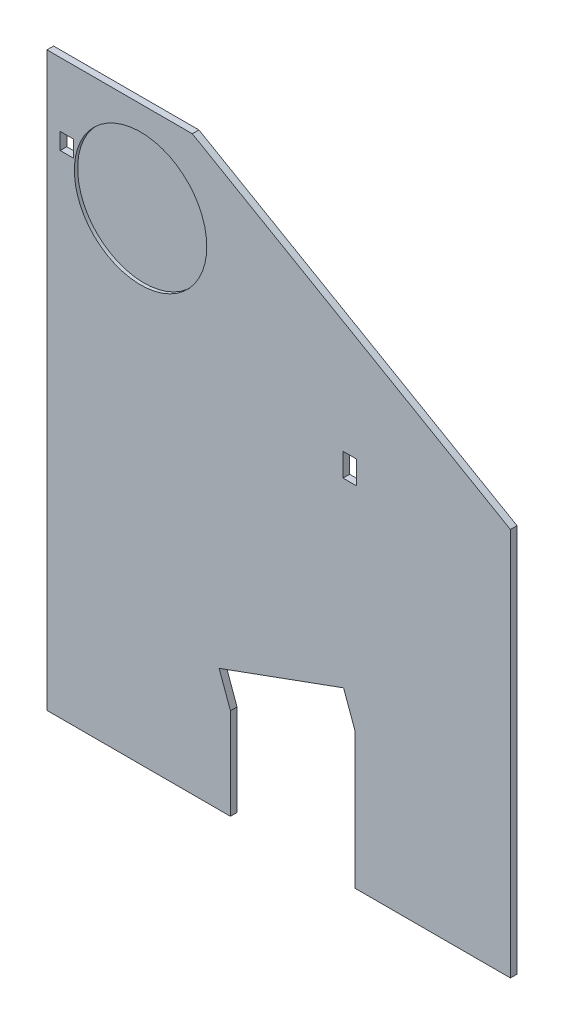
ISO-10303-21;
HEADER;
FILE_DESCRIPTION(('STEP AP214'),'2;1');
FILE_NAME('part.step','',(''),(''),'','','');
FILE_SCHEMA(('AUTOMOTIVE_DESIGN { 1 0 10303 214 1 1 1 1 }'));
ENDSEC;
DATA;
#1=APPLICATION_CONTEXT('core data for automotive mechanical design processes');
#2=APPLICATION_PROTOCOL_DEFINITION('international standard','automotive_design',2000,#1);
#3=PRODUCT_CONTEXT('',#1,'mechanical');
#4=PRODUCT('Part','Part','',(#3));
#5=PRODUCT_RELATED_PRODUCT_CATEGORY('part','',(#4));
#6=PRODUCT_DEFINITION_FORMATION('','',#4);
#7=PRODUCT_DEFINITION_CONTEXT('part definition',#1,'design');
#8=PRODUCT_DEFINITION('design','',#6,#7);
#9=PRODUCT_DEFINITION_SHAPE('','',#8);
#10=(LENGTH_UNIT() NAMED_UNIT(*) SI_UNIT(.MILLI.,.METRE.));
#11=(NAMED_UNIT(*) PLANE_ANGLE_UNIT() SI_UNIT($,.RADIAN.));
#12=(NAMED_UNIT(*) SI_UNIT($,.STERADIAN.) SOLID_ANGLE_UNIT());
#13=UNCERTAINTY_MEASURE_WITH_UNIT(LENGTH_MEASURE(1.E-05),#10,'distance_accuracy_value','');
#14=(GEOMETRIC_REPRESENTATION_CONTEXT(3) GLOBAL_UNCERTAINTY_ASSIGNED_CONTEXT((#13)) GLOBAL_UNIT_ASSIGNED_CONTEXT((#10,
#11,#12)) REPRESENTATION_CONTEXT('',''));
#15=CARTESIAN_POINT('',(0.,0.,0.));
#16=DIRECTION('',(0.,0.,1.));
#17=DIRECTION('',(1.,0.,0.));
#18=AXIS2_PLACEMENT_3D('',#15,#16,#17);
#19=CARTESIAN_POINT('',(-70.,-72.7995401166084,2.));
#20=DIRECTION('',(0.,1.,0.));
#21=DIRECTION('',(0.,0.,1.));
#22=AXIS2_PLACEMENT_3D('',#19,#20,#21);
#23=PLANE('',#22);
#24=DIRECTION('',(1.,0.,0.));
#25=VECTOR('',#24,1.);
#26=CARTESIAN_POINT('',(-70.,-72.7995401166084,0.));
#27=LINE('',#26,#25);
#28=CARTESIAN_POINT('',(-70.,-72.7995401166084,0.));
#29=VERTEX_POINT('',#28);
#30=CARTESIAN_POINT('',(-14.5723358707317,-72.7995401166084,0.));
#31=VERTEX_POINT('',#30);
#32=EDGE_CURVE('E296',#29,#31,#27,.T.);
#33=ORIENTED_EDGE('',*,*,#32,.T.);
#34=DIRECTION('',(0.,0.,1.));
#35=VECTOR('',#34,1.);
#36=CARTESIAN_POINT('',(-14.5723358707317,-72.7995401166084,2.));
#37=LINE('',#36,#35);
#38=CARTESIAN_POINT('',(-14.5723358707317,-72.7995401166084,2.));
#39=VERTEX_POINT('',#38);
#40=EDGE_CURVE('E272',#31,#39,#37,.T.);
#41=ORIENTED_EDGE('',*,*,#40,.T.);
#42=DIRECTION('',(1.,0.,0.));
#43=VECTOR('',#42,1.);
#44=CARTESIAN_POINT('',(-70.,-72.7995401166084,2.));
#45=LINE('',#44,#43);
#46=CARTESIAN_POINT('',(-70.,-72.7995401166084,2.));
#47=VERTEX_POINT('',#46);
#48=EDGE_CURVE('E283',#47,#39,#45,.T.);
#49=ORIENTED_EDGE('',*,*,#48,.F.);
#50=DIRECTION('',(0.,0.,-1.));
#51=VECTOR('',#50,1.);
#52=CARTESIAN_POINT('',(-70.,-72.7995401166084,2.));
#53=LINE('',#52,#51);
#54=EDGE_CURVE('E310',#47,#29,#53,.T.);
#55=ORIENTED_EDGE('',*,*,#54,.T.);
#56=EDGE_LOOP('',(#33,#41,#49,#55));
#57=FACE_BOUND('',#56,.T.);
#58=ADVANCED_FACE('F70',(#57),#23,.F.);
#59=CARTESIAN_POINT('',(0.,0.,2.));
#60=DIRECTION('',(0.,0.,1.));
#61=DIRECTION('',(1.,0.,0.));
#62=AXIS2_PLACEMENT_3D('',#59,#60,#61);
#63=PLANE('',#62);
#64=CARTESIAN_POINT('',(-41.7237205583712,72.6554445662272,2.));
#65=DIRECTION('',(0.,0.,1.));
#66=DIRECTION('',(1.,0.,0.));
#67=AXIS2_PLACEMENT_3D('',#64,#65,#66);
#68=CIRCLE('',#67,20.);
#69=CARTESIAN_POINT('',(-21.7237205583712,72.6554445662272,2.));
#70=VERTEX_POINT('',#69);
#71=EDGE_CURVE('E467',#70,#70,#68,.T.);
#72=ORIENTED_EDGE('',*,*,#71,.F.);
#73=EDGE_LOOP('',(#72));
#74=FACE_BOUND('',#73,.T.);
#75=DIRECTION('',(0.,-1.,0.));
#76=VECTOR('',#75,1.);
#77=CARTESIAN_POINT('',(-14.5723358707317,-45.1845277557284,2.));
#78=LINE('',#77,#76);
#79=CARTESIAN_POINT('',(-14.5723358707317,-45.1845277557284,2.));
#80=VERTEX_POINT('',#79);
#81=EDGE_CURVE('E209',#80,#39,#78,.T.);
#82=ORIENTED_EDGE('',*,*,#81,.F.);
#83=DIRECTION('',(0.342020143325671,-0.939692620785908,0.));
#84=VECTOR('',#83,1.);
#85=CARTESIAN_POINT('',(-27.3897236893445,-9.96904414769732,2.));
#86=LINE('',#85,#84);
#87=CARTESIAN_POINT('',(-17.9925373039883,-35.7876015478698,2.));
#88=VERTEX_POINT('',#87);
#89=EDGE_CURVE('E238',#88,#80,#86,.T.);
#90=ORIENTED_EDGE('',*,*,#89,.F.);
#91=DIRECTION('',(0.939692620785908,0.342020143325671,0.));
#92=VECTOR('',#91,1.);
#93=CARTESIAN_POINT('',(9.39718638535622,-25.8185574001724,2.));
#94=LINE('',#93,#92);
#95=CARTESIAN_POINT('',(19.5951675274481,-22.1067958148429,2.));
#96=VERTEX_POINT('',#95);
#97=EDGE_CURVE('E248',#88,#96,#94,.T.);
#98=ORIENTED_EDGE('',*,*,#97,.T.);
#99=DIRECTION('',(0.342020143325671,-0.939692620785908,0.));
#100=VECTOR('',#99,1.);
#101=CARTESIAN_POINT('',(10.1979811420918,3.71176158532951,2.));
#102=LINE('',#101,#100);
#103=CARTESIAN_POINT('',(23.0153689607046,-31.5037220227017,2.));
#104=VERTEX_POINT('',#103);
#105=EDGE_CURVE('E233',#96,#104,#102,.T.);
#106=ORIENTED_EDGE('',*,*,#105,.T.);
#107=DIRECTION('',(0.,1.,0.));
#108=VECTOR('',#107,1.);
#109=CARTESIAN_POINT('',(23.0153689607046,-75.1845277557284,2.));
#110=LINE('',#109,#108);
#111=CARTESIAN_POINT('',(23.0153689607046,-72.7995401166084,2.));
#112=VERTEX_POINT('',#111);
#113=EDGE_CURVE('E231',#112,#104,#110,.T.);
#114=ORIENTED_EDGE('',*,*,#113,.F.);
#115=CARTESIAN_POINT('',(70.,-72.7995401166084,2.));
#116=VERTEX_POINT('',#115);
#117=EDGE_CURVE('E282',#112,#116,#45,.T.);
#118=ORIENTED_EDGE('',*,*,#117,.T.);
#119=DIRECTION('',(0.,1.,0.));
#120=VECTOR('',#119,1.);
#121=CARTESIAN_POINT('',(70.,-72.7995401166084,2.));
#122=LINE('',#121,#120);
#123=CARTESIAN_POINT('',(70.,44.5247913859315,2.));
#124=VERTEX_POINT('',#123);
#125=EDGE_CURVE('E286',#116,#124,#122,.T.);
#126=ORIENTED_EDGE('',*,*,#125,.T.);
#127=DIRECTION('',(-0.866025403784439,0.5,0.));
#128=VECTOR('',#127,1.);
#129=CARTESIAN_POINT('',(-26.0858798800484,99.9999999999995,2.));
#130=LINE('',#129,#128);
#131=CARTESIAN_POINT('',(-26.0858798800484,99.9999999999995,2.));
#132=VERTEX_POINT('',#131);
#133=EDGE_CURVE('E288',#124,#132,#130,.T.);
#134=ORIENTED_EDGE('',*,*,#133,.T.);
#135=DIRECTION('',(-1.,0.,0.));
#136=VECTOR('',#135,1.);
#137=CARTESIAN_POINT('',(-26.0858798800484,99.9999999999995,2.));
#138=LINE('',#137,#136);
#139=CARTESIAN_POINT('',(-70.,99.9999999999995,2.));
#140=VERTEX_POINT('',#139);
#141=EDGE_CURVE('E276',#132,#140,#138,.T.);
#142=ORIENTED_EDGE('',*,*,#141,.T.);
#143=DIRECTION('',(0.,-1.,0.));
#144=VECTOR('',#143,1.);
#145=CARTESIAN_POINT('',(-70.,99.9999999999995,2.));
#146=LINE('',#145,#144);
#147=EDGE_CURVE('E279',#140,#47,#146,.T.);
#148=ORIENTED_EDGE('',*,*,#147,.T.);
#149=ORIENTED_EDGE('',*,*,#48,.T.);
#150=EDGE_LOOP('',(#82,#90,#98,#106,#114,#118,#126,#134,#142,#148,#149));
#151=FACE_BOUND('',#150,.T.);
#152=DIRECTION('',(0.,1.,0.));
#153=VECTOR('',#152,1.);
#154=CARTESIAN_POINT('',(19.4272395246514,0.,2.));
#155=LINE('',#154,#153);
#156=CARTESIAN_POINT('',(19.4272395246514,32.6900160134943,2.));
#157=VERTEX_POINT('',#156);
#158=CARTESIAN_POINT('',(19.4272395246514,39.6978246648275,2.));
#159=VERTEX_POINT('',#158);
#160=EDGE_CURVE('E226',#157,#159,#155,.T.);
#161=ORIENTED_EDGE('',*,*,#160,.T.);
#162=DIRECTION('',(1.,0.,0.));
#163=VECTOR('',#162,1.);
#164=CARTESIAN_POINT('',(0.,39.6978246648275,2.));
#165=LINE('',#164,#163);
#166=CARTESIAN_POINT('',(23.4317443239711,39.6978246648275,2.));
#167=VERTEX_POINT('',#166);
#168=EDGE_CURVE('E93',#159,#167,#165,.T.);
#169=ORIENTED_EDGE('',*,*,#168,.T.);
#170=DIRECTION('',(0.,1.,0.));
#171=VECTOR('',#170,1.);
#172=CARTESIAN_POINT('',(23.4317443239711,0.,2.));
#173=LINE('',#172,#171);
#174=CARTESIAN_POINT('',(23.4317443239711,32.6900160134943,2.));
#175=VERTEX_POINT('',#174);
#176=EDGE_CURVE('E258',#175,#167,#173,.T.);
#177=ORIENTED_EDGE('',*,*,#176,.F.);
#178=DIRECTION('',(1.,0.,0.));
#179=VECTOR('',#178,1.);
#180=CARTESIAN_POINT('',(0.,32.6900160134943,2.));
#181=LINE('',#180,#179);
#182=EDGE_CURVE('E255',#157,#175,#181,.T.);
#183=ORIENTED_EDGE('',*,*,#182,.F.);
#184=EDGE_LOOP('',(#161,#169,#177,#183));
#185=FACE_BOUND('',#184,.T.);
#186=DIRECTION('',(1.,0.,0.));
#187=VECTOR('',#186,1.);
#188=CARTESIAN_POINT('',(0.,80.6554445662272,2.));
#189=LINE('',#188,#187);
#190=CARTESIAN_POINT('',(-66.,80.6554445662272,2.));
#191=VERTEX_POINT('',#190);
#192=CARTESIAN_POINT('',(-62.,80.6554445662272,2.));
#193=VERTEX_POINT('',#192);
#194=EDGE_CURVE('E224',#191,#193,#189,.T.);
#195=ORIENTED_EDGE('',*,*,#194,.T.);
#196=DIRECTION('',(0.,-1.,0.));
#197=VECTOR('',#196,1.);
#198=CARTESIAN_POINT('',(-62.,0.,2.));
#199=LINE('',#198,#197);
#200=CARTESIAN_POINT('',(-62.,75.6554445662272,2.));
#201=VERTEX_POINT('',#200);
#202=EDGE_CURVE('E85',#193,#201,#199,.T.);
#203=ORIENTED_EDGE('',*,*,#202,.T.);
#204=DIRECTION('',(1.,0.,0.));
#205=VECTOR('',#204,1.);
#206=CARTESIAN_POINT('',(0.,75.6554445662272,2.));
#207=LINE('',#206,#205);
#208=CARTESIAN_POINT('',(-66.,75.6554445662272,2.));
#209=VERTEX_POINT('',#208);
#210=EDGE_CURVE('E212',#209,#201,#207,.T.);
#211=ORIENTED_EDGE('',*,*,#210,.F.);
#212=DIRECTION('',(0.,-1.,0.));
#213=VECTOR('',#212,1.);
#214=CARTESIAN_POINT('',(-66.,0.,2.));
#215=LINE('',#214,#213);
#216=EDGE_CURVE('E218',#191,#209,#215,.T.);
#217=ORIENTED_EDGE('',*,*,#216,.F.);
#218=EDGE_LOOP('',(#195,#203,#211,#217));
#219=FACE_BOUND('',#218,.T.);
#220=ADVANCED_FACE('F222',(#74,#151,#185,#219),#63,.T.);
#221=CARTESIAN_POINT('',(0.,0.,0.));
#222=DIRECTION('',(0.,0.,1.));
#223=DIRECTION('',(1.,0.,0.));
#224=AXIS2_PLACEMENT_3D('',#221,#222,#223);
#225=PLANE('',#224);
#226=DIRECTION('',(1.,0.,0.));
#227=VECTOR('',#226,1.);
#228=CARTESIAN_POINT('',(0.,39.6978246648275,0.));
#229=LINE('',#228,#227);
#230=CARTESIAN_POINT('',(19.4272395246514,39.6978246648275,0.));
#231=VERTEX_POINT('',#230);
#232=CARTESIAN_POINT('',(23.4317443239711,39.6978246648275,0.));
#233=VERTEX_POINT('',#232);
#234=EDGE_CURVE('E324',#231,#233,#229,.T.);
#235=ORIENTED_EDGE('',*,*,#234,.F.);
#236=DIRECTION('',(0.,1.,0.));
#237=VECTOR('',#236,1.);
#238=CARTESIAN_POINT('',(19.4272395246514,0.,0.));
#239=LINE('',#238,#237);
#240=CARTESIAN_POINT('',(19.4272395246514,32.6900160134943,0.));
#241=VERTEX_POINT('',#240);
#242=EDGE_CURVE('E316',#241,#231,#239,.T.);
#243=ORIENTED_EDGE('',*,*,#242,.F.);
#244=DIRECTION('',(1.,0.,0.));
#245=VECTOR('',#244,1.);
#246=CARTESIAN_POINT('',(0.,32.6900160134943,0.));
#247=LINE('',#246,#245);
#248=CARTESIAN_POINT('',(23.4317443239711,32.6900160134943,0.));
#249=VERTEX_POINT('',#248);
#250=EDGE_CURVE('E318',#241,#249,#247,.T.);
#251=ORIENTED_EDGE('',*,*,#250,.T.);
#252=DIRECTION('',(0.,1.,0.));
#253=VECTOR('',#252,1.);
#254=CARTESIAN_POINT('',(23.4317443239711,0.,0.));
#255=LINE('',#254,#253);
#256=EDGE_CURVE('E321',#249,#233,#255,.T.);
#257=ORIENTED_EDGE('',*,*,#256,.T.);
#258=EDGE_LOOP('',(#235,#243,#251,#257));
#259=FACE_BOUND('',#258,.T.);
#260=DIRECTION('',(0.342020143325671,-0.939692620785908,0.));
#261=VECTOR('',#260,1.);
#262=CARTESIAN_POINT('',(-27.3897236893445,-9.96904414769732,0.));
#263=LINE('',#262,#261);
#264=CARTESIAN_POINT('',(-17.9925373039883,-35.7876015478698,0.));
#265=VERTEX_POINT('',#264);
#266=CARTESIAN_POINT('',(-14.5723358707317,-45.1845277557284,0.));
#267=VERTEX_POINT('',#266);
#268=EDGE_CURVE('E334',#265,#267,#263,.T.);
#269=ORIENTED_EDGE('',*,*,#268,.T.);
#270=DIRECTION('',(0.,-1.,0.));
#271=VECTOR('',#270,1.);
#272=CARTESIAN_POINT('',(-14.5723358707317,0.,0.));
#273=LINE('',#272,#271);
#274=EDGE_CURVE('E12',#267,#31,#273,.T.);
#275=ORIENTED_EDGE('',*,*,#274,.T.);
#276=ORIENTED_EDGE('',*,*,#32,.F.);
#277=DIRECTION('',(0.,-1.,0.));
#278=VECTOR('',#277,1.);
#279=CARTESIAN_POINT('',(-70.,99.9999999999995,0.));
#280=LINE('',#279,#278);
#281=CARTESIAN_POINT('',(-70.,99.9999999999995,0.));
#282=VERTEX_POINT('',#281);
#283=EDGE_CURVE('E293',#282,#29,#280,.T.);
#284=ORIENTED_EDGE('',*,*,#283,.F.);
#285=DIRECTION('',(-1.,0.,0.));
#286=VECTOR('',#285,1.);
#287=CARTESIAN_POINT('',(-26.0858798800484,99.9999999999995,0.));
#288=LINE('',#287,#286);
#289=CARTESIAN_POINT('',(-26.0858798800484,99.9999999999995,0.));
#290=VERTEX_POINT('',#289);
#291=EDGE_CURVE('E275',#290,#282,#288,.T.);
#292=ORIENTED_EDGE('',*,*,#291,.F.);
#293=DIRECTION('',(-0.866025403784439,0.5,0.));
#294=VECTOR('',#293,1.);
#295=CARTESIAN_POINT('',(-26.0858798800484,99.9999999999995,0.));
#296=LINE('',#295,#294);
#297=CARTESIAN_POINT('',(70.,44.5247913859315,0.));
#298=VERTEX_POINT('',#297);
#299=EDGE_CURVE('E280',#298,#290,#296,.T.);
#300=ORIENTED_EDGE('',*,*,#299,.F.);
#301=DIRECTION('',(0.,1.,0.));
#302=VECTOR('',#301,1.);
#303=CARTESIAN_POINT('',(70.,-72.7995401166084,0.));
#304=LINE('',#303,#302);
#305=CARTESIAN_POINT('',(70.,-72.7995401166084,0.));
#306=VERTEX_POINT('',#305);
#307=EDGE_CURVE('E299',#306,#298,#304,.T.);
#308=ORIENTED_EDGE('',*,*,#307,.F.);
#309=CARTESIAN_POINT('',(23.0153689607046,-72.7995401166084,0.));
#310=VERTEX_POINT('',#309);
#311=EDGE_CURVE('E295',#310,#306,#27,.T.);
#312=ORIENTED_EDGE('',*,*,#311,.F.);
#313=DIRECTION('',(0.,1.,0.));
#314=VECTOR('',#313,1.);
#315=CARTESIAN_POINT('',(23.0153689607046,0.,0.));
#316=LINE('',#315,#314);
#317=CARTESIAN_POINT('',(23.0153689607046,-31.5037220227017,0.));
#318=VERTEX_POINT('',#317);
#319=EDGE_CURVE('E78',#310,#318,#316,.T.);
#320=ORIENTED_EDGE('',*,*,#319,.T.);
#321=DIRECTION('',(0.342020143325671,-0.939692620785908,0.));
#322=VECTOR('',#321,1.);
#323=CARTESIAN_POINT('',(10.1979811420918,3.71176158532951,0.));
#324=LINE('',#323,#322);
#325=CARTESIAN_POINT('',(19.5951675274481,-22.1067958148429,0.));
#326=VERTEX_POINT('',#325);
#327=EDGE_CURVE('E339',#326,#318,#324,.T.);
#328=ORIENTED_EDGE('',*,*,#327,.F.);
#329=DIRECTION('',(0.939692620785908,0.342020143325671,0.));
#330=VECTOR('',#329,1.);
#331=CARTESIAN_POINT('',(9.39718638535622,-25.8185574001724,0.));
#332=LINE('',#331,#330);
#333=EDGE_CURVE('E337',#265,#326,#332,.T.);
#334=ORIENTED_EDGE('',*,*,#333,.F.);
#335=EDGE_LOOP('',(#269,#275,#276,#284,#292,#300,#308,#312,#320,#328,#334));
#336=FACE_BOUND('',#335,.T.);
#337=DIRECTION('',(0.,-1.,0.));
#338=VECTOR('',#337,1.);
#339=CARTESIAN_POINT('',(-62.,0.,0.));
#340=LINE('',#339,#338);
#341=CARTESIAN_POINT('',(-62.,80.6554445662272,0.));
#342=VERTEX_POINT('',#341);
#343=CARTESIAN_POINT('',(-62.,75.6554445662272,0.));
#344=VERTEX_POINT('',#343);
#345=EDGE_CURVE('E205',#342,#344,#340,.T.);
#346=ORIENTED_EDGE('',*,*,#345,.F.);
#347=DIRECTION('',(1.,0.,0.));
#348=VECTOR('',#347,1.);
#349=CARTESIAN_POINT('',(0.,80.6554445662272,0.));
#350=LINE('',#349,#348);
#351=CARTESIAN_POINT('',(-66.,80.6554445662272,0.));
#352=VERTEX_POINT('',#351);
#353=EDGE_CURVE('E326',#352,#342,#350,.T.);
#354=ORIENTED_EDGE('',*,*,#353,.F.);
#355=DIRECTION('',(0.,-1.,0.));
#356=VECTOR('',#355,1.);
#357=CARTESIAN_POINT('',(-66.,0.,0.));
#358=LINE('',#357,#356);
#359=CARTESIAN_POINT('',(-66.,75.6554445662272,0.));
#360=VERTEX_POINT('',#359);
#361=EDGE_CURVE('E328',#352,#360,#358,.T.);
#362=ORIENTED_EDGE('',*,*,#361,.T.);
#363=DIRECTION('',(1.,0.,0.));
#364=VECTOR('',#363,1.);
#365=CARTESIAN_POINT('',(0.,75.6554445662272,0.));
#366=LINE('',#365,#364);
#367=EDGE_CURVE('E331',#360,#344,#366,.T.);
#368=ORIENTED_EDGE('',*,*,#367,.T.);
#369=EDGE_LOOP('',(#346,#354,#362,#368));
#370=FACE_BOUND('',#369,.T.);
#371=ADVANCED_FACE('F344',(#259,#336,#370),#225,.F.);
#372=CARTESIAN_POINT('',(-26.0858798800484,99.9999999999995,2.));
#373=DIRECTION('',(0.,-1.,0.));
#374=DIRECTION('',(0.,0.,-1.));
#375=AXIS2_PLACEMENT_3D('',#372,#373,#374);
#376=PLANE('',#375);
#377=ORIENTED_EDGE('',*,*,#291,.T.);
#378=DIRECTION('',(0.,0.,-1.));
#379=VECTOR('',#378,1.);
#380=CARTESIAN_POINT('',(-70.,99.9999999999995,2.));
#381=LINE('',#380,#379);
#382=EDGE_CURVE('E313',#140,#282,#381,.T.);
#383=ORIENTED_EDGE('',*,*,#382,.F.);
#384=ORIENTED_EDGE('',*,*,#141,.F.);
#385=DIRECTION('',(0.,0.,-1.));
#386=VECTOR('',#385,1.);
#387=CARTESIAN_POINT('',(-26.0858798800484,99.9999999999995,2.));
#388=LINE('',#387,#386);
#389=EDGE_CURVE('E290',#132,#290,#388,.T.);
#390=ORIENTED_EDGE('',*,*,#389,.T.);
#391=EDGE_LOOP('',(#377,#383,#384,#390));
#392=FACE_BOUND('',#391,.T.);
#393=ADVANCED_FACE('F72',(#392),#376,.F.);
#394=CARTESIAN_POINT('',(-70.,99.9999999999995,2.));
#395=DIRECTION('',(1.,0.,0.));
#396=DIRECTION('',(0.,1.,0.));
#397=AXIS2_PLACEMENT_3D('',#394,#395,#396);
#398=PLANE('',#397);
#399=ORIENTED_EDGE('',*,*,#283,.T.);
#400=ORIENTED_EDGE('',*,*,#54,.F.);
#401=ORIENTED_EDGE('',*,*,#147,.F.);
#402=ORIENTED_EDGE('',*,*,#382,.T.);
#403=EDGE_LOOP('',(#399,#400,#401,#402));
#404=FACE_BOUND('',#403,.T.);
#405=ADVANCED_FACE('F382',(#404),#398,.F.);
#406=ORIENTED_EDGE('',*,*,#117,.F.);
#407=DIRECTION('',(0.,0.,-1.));
#408=VECTOR('',#407,1.);
#409=CARTESIAN_POINT('',(23.0153689607046,-72.7995401166084,2.));
#410=LINE('',#409,#408);
#411=EDGE_CURVE('E264',#112,#310,#410,.T.);
#412=ORIENTED_EDGE('',*,*,#411,.T.);
#413=ORIENTED_EDGE('',*,*,#311,.T.);
#414=DIRECTION('',(0.,0.,-1.));
#415=VECTOR('',#414,1.);
#416=CARTESIAN_POINT('',(70.,-72.7995401166084,2.));
#417=LINE('',#416,#415);
#418=EDGE_CURVE('E307',#116,#306,#417,.T.);
#419=ORIENTED_EDGE('',*,*,#418,.F.);
#420=EDGE_LOOP('',(#406,#412,#413,#419));
#421=FACE_BOUND('',#420,.T.);
#422=ADVANCED_FACE('F354',(#421),#23,.F.);
#423=CARTESIAN_POINT('',(70.,-72.7995401166084,2.));
#424=DIRECTION('',(-1.,0.,0.));
#425=DIRECTION('',(0.,-1.,0.));
#426=AXIS2_PLACEMENT_3D('',#423,#424,#425);
#427=PLANE('',#426);
#428=ORIENTED_EDGE('',*,*,#307,.T.);
#429=DIRECTION('',(0.,0.,-1.));
#430=VECTOR('',#429,1.);
#431=CARTESIAN_POINT('',(70.,44.5247913859315,2.));
#432=LINE('',#431,#430);
#433=EDGE_CURVE('E304',#124,#298,#432,.T.);
#434=ORIENTED_EDGE('',*,*,#433,.F.);
#435=ORIENTED_EDGE('',*,*,#125,.F.);
#436=ORIENTED_EDGE('',*,*,#418,.T.);
#437=EDGE_LOOP('',(#428,#434,#435,#436));
#438=FACE_BOUND('',#437,.T.);
#439=ADVANCED_FACE('F391',(#438),#427,.F.);
#440=CARTESIAN_POINT('',(-26.0858798800484,99.9999999999995,2.));
#441=DIRECTION('',(-0.5,-0.866025403784439,0.));
#442=DIRECTION('',(0.866025403784439,-0.5,0.));
#443=AXIS2_PLACEMENT_3D('',#440,#441,#442);
#444=PLANE('',#443);
#445=ORIENTED_EDGE('',*,*,#299,.T.);
#446=ORIENTED_EDGE('',*,*,#389,.F.);
#447=ORIENTED_EDGE('',*,*,#133,.F.);
#448=ORIENTED_EDGE('',*,*,#433,.T.);
#449=EDGE_LOOP('',(#445,#446,#447,#448));
#450=FACE_BOUND('',#449,.T.);
#451=ADVANCED_FACE('F389',(#450),#444,.F.);
#452=CARTESIAN_POINT('',(0.,39.6978246648275,-8.));
#453=DIRECTION('',(0.,-1.,0.));
#454=DIRECTION('',(0.,0.,-1.));
#455=AXIS2_PLACEMENT_3D('',#452,#453,#454);
#456=PLANE('',#455);
#457=ORIENTED_EDGE('',*,*,#234,.T.);
#458=DIRECTION('',(0.,0.,1.));
#459=VECTOR('',#458,1.);
#460=CARTESIAN_POINT('',(23.4317443239711,39.6978246648275,-8.));
#461=LINE('',#460,#459);
#462=EDGE_CURVE('E262',#233,#167,#461,.T.);
#463=ORIENTED_EDGE('',*,*,#462,.T.);
#464=ORIENTED_EDGE('',*,*,#168,.F.);
#465=DIRECTION('',(0.,0.,1.));
#466=VECTOR('',#465,1.);
#467=CARTESIAN_POINT('',(19.4272395246514,39.6978246648275,-8.));
#468=LINE('',#467,#466);
#469=EDGE_CURVE('E261',#231,#159,#468,.T.);
#470=ORIENTED_EDGE('',*,*,#469,.F.);
#471=EDGE_LOOP('',(#457,#463,#464,#470));
#472=FACE_BOUND('',#471,.T.);
#473=ADVANCED_FACE('F398',(#472),#456,.T.);
#474=CARTESIAN_POINT('',(23.4317443239711,0.,-8.));
#475=DIRECTION('',(1.,0.,0.));
#476=DIRECTION('',(0.,0.,-1.));
#477=AXIS2_PLACEMENT_3D('',#474,#475,#476);
#478=PLANE('',#477);
#479=DIRECTION('',(0.,0.,1.));
#480=VECTOR('',#479,1.);
#481=CARTESIAN_POINT('',(23.4317443239711,32.6900160134943,-8.));
#482=LINE('',#481,#480);
#483=EDGE_CURVE('E265',#249,#175,#482,.T.);
#484=ORIENTED_EDGE('',*,*,#483,.T.);
#485=ORIENTED_EDGE('',*,*,#176,.T.);
#486=ORIENTED_EDGE('',*,*,#462,.F.);
#487=ORIENTED_EDGE('',*,*,#256,.F.);
#488=EDGE_LOOP('',(#484,#485,#486,#487));
#489=FACE_BOUND('',#488,.T.);
#490=ADVANCED_FACE('F422',(#489),#478,.F.);
#491=CARTESIAN_POINT('',(0.,32.6900160134943,-8.));
#492=DIRECTION('',(0.,-1.,0.));
#493=DIRECTION('',(0.,0.,-1.));
#494=AXIS2_PLACEMENT_3D('',#491,#492,#493);
#495=PLANE('',#494);
#496=DIRECTION('',(0.,0.,1.));
#497=VECTOR('',#496,1.);
#498=CARTESIAN_POINT('',(19.4272395246514,32.6900160134943,-8.));
#499=LINE('',#498,#497);
#500=EDGE_CURVE('E267',#241,#157,#499,.T.);
#501=ORIENTED_EDGE('',*,*,#500,.T.);
#502=ORIENTED_EDGE('',*,*,#182,.T.);
#503=ORIENTED_EDGE('',*,*,#483,.F.);
#504=ORIENTED_EDGE('',*,*,#250,.F.);
#505=EDGE_LOOP('',(#501,#502,#503,#504));
#506=FACE_BOUND('',#505,.T.);
#507=ADVANCED_FACE('F426',(#506),#495,.F.);
#508=CARTESIAN_POINT('',(19.4272395246514,0.,-8.));
#509=DIRECTION('',(1.,0.,0.));
#510=DIRECTION('',(0.,0.,-1.));
#511=AXIS2_PLACEMENT_3D('',#508,#509,#510);
#512=PLANE('',#511);
#513=ORIENTED_EDGE('',*,*,#242,.T.);
#514=ORIENTED_EDGE('',*,*,#469,.T.);
#515=ORIENTED_EDGE('',*,*,#160,.F.);
#516=ORIENTED_EDGE('',*,*,#500,.F.);
#517=EDGE_LOOP('',(#513,#514,#515,#516));
#518=FACE_BOUND('',#517,.T.);
#519=ADVANCED_FACE('F423',(#518),#512,.T.);
#520=CARTESIAN_POINT('',(-62.,0.,-8.));
#521=DIRECTION('',(-1.,0.,0.));
#522=DIRECTION('',(0.,0.,1.));
#523=AXIS2_PLACEMENT_3D('',#520,#521,#522);
#524=PLANE('',#523);
#525=ORIENTED_EDGE('',*,*,#345,.T.);
#526=DIRECTION('',(0.,0.,1.));
#527=VECTOR('',#526,1.);
#528=CARTESIAN_POINT('',(-62.,75.6554445662272,-8.));
#529=LINE('',#528,#527);
#530=EDGE_CURVE('E201',#344,#201,#529,.T.);
#531=ORIENTED_EDGE('',*,*,#530,.T.);
#532=ORIENTED_EDGE('',*,*,#202,.F.);
#533=DIRECTION('',(0.,0.,1.));
#534=VECTOR('',#533,1.);
#535=CARTESIAN_POINT('',(-62.,80.6554445662272,-8.));
#536=LINE('',#535,#534);
#537=EDGE_CURVE('E219',#342,#193,#536,.T.);
#538=ORIENTED_EDGE('',*,*,#537,.F.);
#539=EDGE_LOOP('',(#525,#531,#532,#538));
#540=FACE_BOUND('',#539,.T.);
#541=ADVANCED_FACE('F203',(#540),#524,.T.);
#542=CARTESIAN_POINT('',(0.,75.6554445662272,-8.));
#543=DIRECTION('',(0.,-1.,0.));
#544=DIRECTION('',(0.,0.,-1.));
#545=AXIS2_PLACEMENT_3D('',#542,#543,#544);
#546=PLANE('',#545);
#547=DIRECTION('',(0.,0.,1.));
#548=VECTOR('',#547,1.);
#549=CARTESIAN_POINT('',(-66.,75.6554445662272,-8.));
#550=LINE('',#549,#548);
#551=EDGE_CURVE('E208',#360,#209,#550,.T.);
#552=ORIENTED_EDGE('',*,*,#551,.T.);
#553=ORIENTED_EDGE('',*,*,#210,.T.);
#554=ORIENTED_EDGE('',*,*,#530,.F.);
#555=ORIENTED_EDGE('',*,*,#367,.F.);
#556=EDGE_LOOP('',(#552,#553,#554,#555));
#557=FACE_BOUND('',#556,.T.);
#558=ADVANCED_FACE('F213',(#557),#546,.F.);
#559=CARTESIAN_POINT('',(-66.,0.,-8.));
#560=DIRECTION('',(-1.,0.,0.));
#561=DIRECTION('',(0.,0.,1.));
#562=AXIS2_PLACEMENT_3D('',#559,#560,#561);
#563=PLANE('',#562);
#564=DIRECTION('',(0.,0.,1.));
#565=VECTOR('',#564,1.);
#566=CARTESIAN_POINT('',(-66.,80.6554445662272,-8.));
#567=LINE('',#566,#565);
#568=EDGE_CURVE('E473',#352,#191,#567,.T.);
#569=ORIENTED_EDGE('',*,*,#568,.T.);
#570=ORIENTED_EDGE('',*,*,#216,.T.);
#571=ORIENTED_EDGE('',*,*,#551,.F.);
#572=ORIENTED_EDGE('',*,*,#361,.F.);
#573=EDGE_LOOP('',(#569,#570,#571,#572));
#574=FACE_BOUND('',#573,.T.);
#575=ADVANCED_FACE('F448',(#574),#563,.F.);
#576=CARTESIAN_POINT('',(0.,80.6554445662272,-8.));
#577=DIRECTION('',(0.,-1.,0.));
#578=DIRECTION('',(0.,0.,-1.));
#579=AXIS2_PLACEMENT_3D('',#576,#577,#578);
#580=PLANE('',#579);
#581=ORIENTED_EDGE('',*,*,#353,.T.);
#582=ORIENTED_EDGE('',*,*,#537,.T.);
#583=ORIENTED_EDGE('',*,*,#194,.F.);
#584=ORIENTED_EDGE('',*,*,#568,.F.);
#585=EDGE_LOOP('',(#581,#582,#583,#584));
#586=FACE_BOUND('',#585,.T.);
#587=ADVANCED_FACE('F436',(#586),#580,.T.);
#588=CARTESIAN_POINT('',(-14.5723358707317,0.,-8.));
#589=DIRECTION('',(-1.,0.,0.));
#590=DIRECTION('',(0.,-1.,0.));
#591=AXIS2_PLACEMENT_3D('',#588,#589,#590);
#592=PLANE('',#591);
#593=ORIENTED_EDGE('',*,*,#274,.F.);
#594=DIRECTION('',(0.,0.,1.));
#595=VECTOR('',#594,1.);
#596=CARTESIAN_POINT('',(-14.5723358707317,-45.1845277557284,-8.));
#597=LINE('',#596,#595);
#598=EDGE_CURVE('E243',#267,#80,#597,.T.);
#599=ORIENTED_EDGE('',*,*,#598,.T.);
#600=ORIENTED_EDGE('',*,*,#81,.T.);
#601=ORIENTED_EDGE('',*,*,#40,.F.);
#602=EDGE_LOOP('',(#593,#599,#600,#601));
#603=FACE_BOUND('',#602,.T.);
#604=ADVANCED_FACE('F375',(#603),#592,.F.);
#605=CARTESIAN_POINT('',(23.0153689607046,0.,-8.));
#606=DIRECTION('',(1.,0.,0.));
#607=DIRECTION('',(0.,0.,-1.));
#608=AXIS2_PLACEMENT_3D('',#605,#606,#607);
#609=PLANE('',#608);
#610=ORIENTED_EDGE('',*,*,#113,.T.);
#611=DIRECTION('',(0.,0.,1.));
#612=VECTOR('',#611,1.);
#613=CARTESIAN_POINT('',(23.0153689607046,-31.5037220227017,-8.));
#614=LINE('',#613,#612);
#615=EDGE_CURVE('E235',#318,#104,#614,.T.);
#616=ORIENTED_EDGE('',*,*,#615,.F.);
#617=ORIENTED_EDGE('',*,*,#319,.F.);
#618=ORIENTED_EDGE('',*,*,#411,.F.);
#619=EDGE_LOOP('',(#610,#616,#617,#618));
#620=FACE_BOUND('',#619,.T.);
#621=ADVANCED_FACE('F350',(#620),#609,.F.);
#622=CARTESIAN_POINT('',(10.1979811420918,3.71176158532951,-8.));
#623=DIRECTION('',(-0.939692620785908,-0.342020143325671,0.));
#624=DIRECTION('',(0.342020143325671,-0.939692620785908,0.));
#625=AXIS2_PLACEMENT_3D('',#622,#623,#624);
#626=PLANE('',#625);
#627=ORIENTED_EDGE('',*,*,#327,.T.);
#628=ORIENTED_EDGE('',*,*,#615,.T.);
#629=ORIENTED_EDGE('',*,*,#105,.F.);
#630=DIRECTION('',(0.,0.,1.));
#631=VECTOR('',#630,1.);
#632=CARTESIAN_POINT('',(19.5951675274481,-22.1067958148429,-8.));
#633=LINE('',#632,#631);
#634=EDGE_CURVE('E239',#326,#96,#633,.T.);
#635=ORIENTED_EDGE('',*,*,#634,.F.);
#636=EDGE_LOOP('',(#627,#628,#629,#635));
#637=FACE_BOUND('',#636,.T.);
#638=ADVANCED_FACE('F363',(#637),#626,.T.);
#639=CARTESIAN_POINT('',(9.39718638535622,-25.8185574001724,-8.));
#640=DIRECTION('',(0.342020143325671,-0.939692620785908,0.));
#641=DIRECTION('',(0.939692620785908,0.342020143325671,0.));
#642=AXIS2_PLACEMENT_3D('',#639,#640,#641);
#643=PLANE('',#642);
#644=ORIENTED_EDGE('',*,*,#333,.T.);
#645=ORIENTED_EDGE('',*,*,#634,.T.);
#646=ORIENTED_EDGE('',*,*,#97,.F.);
#647=DIRECTION('',(0.,0.,1.));
#648=VECTOR('',#647,1.);
#649=CARTESIAN_POINT('',(-17.9925373039883,-35.7876015478698,-8.));
#650=LINE('',#649,#648);
#651=EDGE_CURVE('E241',#265,#88,#650,.T.);
#652=ORIENTED_EDGE('',*,*,#651,.F.);
#653=EDGE_LOOP('',(#644,#645,#646,#652));
#654=FACE_BOUND('',#653,.T.);
#655=ADVANCED_FACE('F367',(#654),#643,.T.);
#656=CARTESIAN_POINT('',(-27.3897236893445,-9.96904414769732,-8.));
#657=DIRECTION('',(-0.939692620785908,-0.342020143325671,0.));
#658=DIRECTION('',(0.342020143325671,-0.939692620785908,0.));
#659=AXIS2_PLACEMENT_3D('',#656,#657,#658);
#660=PLANE('',#659);
#661=ORIENTED_EDGE('',*,*,#651,.T.);
#662=ORIENTED_EDGE('',*,*,#89,.T.);
#663=ORIENTED_EDGE('',*,*,#598,.F.);
#664=ORIENTED_EDGE('',*,*,#268,.F.);
#665=EDGE_LOOP('',(#661,#662,#663,#664));
#666=FACE_BOUND('',#665,.T.);
#667=ADVANCED_FACE('F373',(#666),#660,.F.);
#668=CARTESIAN_POINT('',(-41.7237205583712,72.6554445662272,1.));
#669=DIRECTION('',(0.,0.,1.));
#670=DIRECTION('',(1.,0.,0.));
#671=AXIS2_PLACEMENT_3D('',#668,#669,#670);
#672=CYLINDRICAL_SURFACE('',#671,20.);
#673=CARTESIAN_POINT('',(-41.7237205583712,72.6554445662272,1.));
#674=DIRECTION('',(0.,0.,1.));
#675=DIRECTION('',(1.,0.,0.));
#676=AXIS2_PLACEMENT_3D('',#673,#674,#675);
#677=CIRCLE('',#676,20.);
#678=CARTESIAN_POINT('',(-21.7237205583712,72.6554445662272,1.));
#679=VERTEX_POINT('',#678);
#680=EDGE_CURVE('E245',#679,#679,#677,.T.);
#681=ORIENTED_EDGE('',*,*,#680,.F.);
#682=EDGE_LOOP('',(#681));
#683=FACE_BOUND('',#682,.T.);
#684=ORIENTED_EDGE('',*,*,#71,.T.);
#685=EDGE_LOOP('',(#684));
#686=FACE_BOUND('',#685,.T.);
#687=ADVANCED_FACE('F439',(#683,#686),#672,.F.);
#688=CARTESIAN_POINT('',(-41.7237205583712,72.6554445662272,1.));
#689=DIRECTION('',(0.,0.,1.));
#690=DIRECTION('',(1.,0.,0.));
#691=AXIS2_PLACEMENT_3D('',#688,#689,#690);
#692=PLANE('',#691);
#693=ORIENTED_EDGE('',*,*,#680,.T.);
#694=EDGE_LOOP('',(#693));
#695=FACE_BOUND('',#694,.T.);
#696=ADVANCED_FACE('F459',(#695),#692,.T.);
#697=CLOSED_SHELL('',(#58,#220,#371,#393,#405,#422,#439,#451,#473,#490,#507,#519,#541,#558,#575,
#587,#604,#621,#638,#655,#667,#687,#696));
#698=MANIFOLD_SOLID_BREP('B2',#697);
#699=ADVANCED_BREP_SHAPE_REPRESENTATION('',(#18,#698),#14);
#700=SHAPE_DEFINITION_REPRESENTATION(#9,#699);
ENDSEC;
END-ISO-10303-21;
